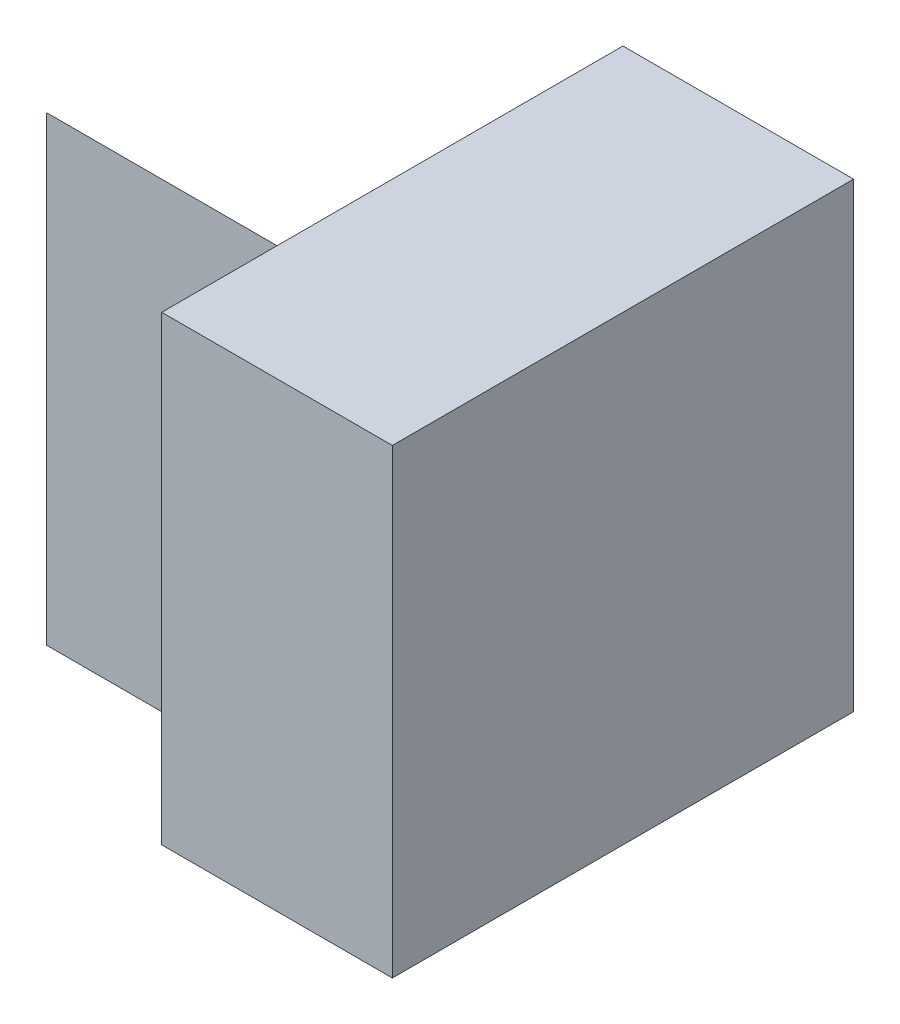
ISO-10303-21;
HEADER;
FILE_DESCRIPTION(('STEP AP214'),'2;1');
FILE_NAME('part.step','',(''),(''),'','','');
FILE_SCHEMA(('AUTOMOTIVE_DESIGN { 1 0 10303 214 1 1 1 1 }'));
ENDSEC;
DATA;
#1=APPLICATION_CONTEXT('core data for automotive mechanical design processes');
#2=APPLICATION_PROTOCOL_DEFINITION('international standard','automotive_design',2000,#1);
#3=PRODUCT_CONTEXT('',#1,'mechanical');
#4=PRODUCT('Part','Part','',(#3));
#5=PRODUCT_RELATED_PRODUCT_CATEGORY('part','',(#4));
#6=PRODUCT_DEFINITION_FORMATION('','',#4);
#7=PRODUCT_DEFINITION_CONTEXT('part definition',#1,'design');
#8=PRODUCT_DEFINITION('design','',#6,#7);
#9=PRODUCT_DEFINITION_SHAPE('','',#8);
#10=(LENGTH_UNIT() NAMED_UNIT(*) SI_UNIT(.MILLI.,.METRE.));
#11=(NAMED_UNIT(*) PLANE_ANGLE_UNIT() SI_UNIT($,.RADIAN.));
#12=(NAMED_UNIT(*) SI_UNIT($,.STERADIAN.) SOLID_ANGLE_UNIT());
#13=UNCERTAINTY_MEASURE_WITH_UNIT(LENGTH_MEASURE(1.E-05),#10,'distance_accuracy_value','');
#14=(GEOMETRIC_REPRESENTATION_CONTEXT(3) GLOBAL_UNCERTAINTY_ASSIGNED_CONTEXT((#13)) GLOBAL_UNIT_ASSIGNED_CONTEXT((#10,
#11,#12)) REPRESENTATION_CONTEXT('',''));
#15=CARTESIAN_POINT('',(0.,0.,0.));
#16=DIRECTION('',(0.,0.,1.));
#17=DIRECTION('',(1.,0.,0.));
#18=AXIS2_PLACEMENT_3D('',#15,#16,#17);
#19=CARTESIAN_POINT('',(2.,0.,-4.));
#20=DIRECTION('',(0.,0.,1.));
#21=DIRECTION('',(1.,0.,0.));
#22=AXIS2_PLACEMENT_3D('',#19,#20,#21);
#23=PLANE('',#22);
#24=DIRECTION('',(0.,-1.,0.));
#25=VECTOR('',#24,1.);
#26=CARTESIAN_POINT('',(0.,0.,-4.));
#27=LINE('',#26,#25);
#28=CARTESIAN_POINT('',(0.,4.,-4.));
#29=VERTEX_POINT('',#28);
#30=CARTESIAN_POINT('',(0.,0.,-4.));
#31=VERTEX_POINT('',#30);
#32=EDGE_CURVE('E102',#29,#31,#27,.T.);
#33=ORIENTED_EDGE('',*,*,#32,.F.);
#34=DIRECTION('',(-1.,0.,0.));
#35=VECTOR('',#34,1.);
#36=CARTESIAN_POINT('',(2.,4.,-4.));
#37=LINE('',#36,#35);
#38=CARTESIAN_POINT('',(2.,4.,-4.));
#39=VERTEX_POINT('',#38);
#40=EDGE_CURVE('E112',#39,#29,#37,.T.);
#41=ORIENTED_EDGE('',*,*,#40,.F.);
#42=DIRECTION('',(0.,1.,0.));
#43=VECTOR('',#42,1.);
#44=CARTESIAN_POINT('',(2.,0.,-4.));
#45=LINE('',#44,#43);
#46=CARTESIAN_POINT('',(2.,0.,-4.));
#47=VERTEX_POINT('',#46);
#48=EDGE_CURVE('E134',#47,#39,#45,.T.);
#49=ORIENTED_EDGE('',*,*,#48,.F.);
#50=DIRECTION('',(-1.,0.,0.));
#51=VECTOR('',#50,1.);
#52=CARTESIAN_POINT('',(2.,0.,-4.));
#53=LINE('',#52,#51);
#54=EDGE_CURVE('E42',#47,#31,#53,.T.);
#55=ORIENTED_EDGE('',*,*,#54,.T.);
#56=EDGE_LOOP('',(#33,#41,#49,#55));
#57=FACE_BOUND('',#56,.T.);
#58=ADVANCED_FACE('F33',(#57),#23,.F.);
#59=CARTESIAN_POINT('',(2.,4.,0.));
#60=DIRECTION('',(0.,-1.,0.));
#61=DIRECTION('',(0.,0.,-1.));
#62=AXIS2_PLACEMENT_3D('',#59,#60,#61);
#63=PLANE('',#62);
#64=DIRECTION('',(0.,0.,-1.));
#65=VECTOR('',#64,1.);
#66=CARTESIAN_POINT('',(0.,4.,-4.));
#67=LINE('',#66,#65);
#68=CARTESIAN_POINT('',(0.,4.,-1.));
#69=VERTEX_POINT('',#68);
#70=EDGE_CURVE('E99',#69,#29,#67,.T.);
#71=ORIENTED_EDGE('',*,*,#70,.F.);
#72=DIRECTION('',(0.,0.,1.));
#73=VECTOR('',#72,1.);
#74=CARTESIAN_POINT('',(0.,4.,0.));
#75=LINE('',#74,#73);
#76=CARTESIAN_POINT('',(0.,4.,0.));
#77=VERTEX_POINT('',#76);
#78=EDGE_CURVE('E72',#69,#77,#75,.T.);
#79=ORIENTED_EDGE('',*,*,#78,.T.);
#80=DIRECTION('',(-1.,0.,0.));
#81=VECTOR('',#80,1.);
#82=CARTESIAN_POINT('',(2.,4.,0.));
#83=LINE('',#82,#81);
#84=CARTESIAN_POINT('',(2.,4.,0.));
#85=VERTEX_POINT('',#84);
#86=EDGE_CURVE('E115',#85,#77,#83,.T.);
#87=ORIENTED_EDGE('',*,*,#86,.F.);
#88=DIRECTION('',(0.,0.,1.));
#89=VECTOR('',#88,1.);
#90=CARTESIAN_POINT('',(2.,4.,0.));
#91=LINE('',#90,#89);
#92=EDGE_CURVE('E59',#39,#85,#91,.T.);
#93=ORIENTED_EDGE('',*,*,#92,.F.);
#94=ORIENTED_EDGE('',*,*,#40,.T.);
#95=EDGE_LOOP('',(#71,#79,#87,#93,#94));
#96=FACE_BOUND('',#95,.T.);
#97=ADVANCED_FACE('F114',(#96),#63,.F.);
#98=CARTESIAN_POINT('',(2.,0.,0.));
#99=DIRECTION('',(0.,0.,-1.));
#100=DIRECTION('',(-1.,0.,0.));
#101=AXIS2_PLACEMENT_3D('',#98,#99,#100);
#102=PLANE('',#101);
#103=DIRECTION('',(0.,-1.,0.));
#104=VECTOR('',#103,1.);
#105=CARTESIAN_POINT('',(0.,0.,0.));
#106=LINE('',#105,#104);
#107=CARTESIAN_POINT('',(0.,0.,0.));
#108=VERTEX_POINT('',#107);
#109=EDGE_CURVE('E129',#77,#108,#106,.T.);
#110=ORIENTED_EDGE('',*,*,#109,.T.);
#111=DIRECTION('',(-1.,0.,0.));
#112=VECTOR('',#111,1.);
#113=CARTESIAN_POINT('',(2.,0.,0.));
#114=LINE('',#113,#112);
#115=CARTESIAN_POINT('',(2.,0.,0.));
#116=VERTEX_POINT('',#115);
#117=EDGE_CURVE('E11',#116,#108,#114,.T.);
#118=ORIENTED_EDGE('',*,*,#117,.F.);
#119=DIRECTION('',(0.,-1.,0.));
#120=VECTOR('',#119,1.);
#121=CARTESIAN_POINT('',(2.,0.,0.));
#122=LINE('',#121,#120);
#123=EDGE_CURVE('E122',#85,#116,#122,.T.);
#124=ORIENTED_EDGE('',*,*,#123,.F.);
#125=ORIENTED_EDGE('',*,*,#86,.T.);
#126=EDGE_LOOP('',(#110,#118,#124,#125));
#127=FACE_BOUND('',#126,.T.);
#128=ADVANCED_FACE('F35',(#127),#102,.F.);
#129=CARTESIAN_POINT('',(2.,0.,0.));
#130=DIRECTION('',(0.,1.,0.));
#131=DIRECTION('',(0.,0.,1.));
#132=AXIS2_PLACEMENT_3D('',#129,#130,#131);
#133=PLANE('',#132);
#134=DIRECTION('',(0.,0.,-1.));
#135=VECTOR('',#134,1.);
#136=CARTESIAN_POINT('',(0.,0.,0.));
#137=LINE('',#136,#135);
#138=CARTESIAN_POINT('',(0.,0.,-1.));
#139=VERTEX_POINT('',#138);
#140=EDGE_CURVE('E123',#108,#139,#137,.T.);
#141=ORIENTED_EDGE('',*,*,#140,.T.);
#142=DIRECTION('',(1.,0.,0.));
#143=VECTOR('',#142,1.);
#144=CARTESIAN_POINT('',(-2.,0.,-1.));
#145=LINE('',#144,#143);
#146=CARTESIAN_POINT('',(-2.,0.,-1.));
#147=VERTEX_POINT('',#146);
#148=EDGE_CURVE('E132',#147,#139,#145,.T.);
#149=ORIENTED_EDGE('',*,*,#148,.F.);
#150=DIRECTION('',(0.,0.,1.));
#151=VECTOR('',#150,1.);
#152=CARTESIAN_POINT('',(-2.,0.,-4.));
#153=LINE('',#152,#151);
#154=CARTESIAN_POINT('',(-2.,0.,-4.));
#155=VERTEX_POINT('',#154);
#156=EDGE_CURVE('E143',#155,#147,#153,.T.);
#157=ORIENTED_EDGE('',*,*,#156,.F.);
#158=DIRECTION('',(-1.,0.,0.));
#159=VECTOR('',#158,1.);
#160=CARTESIAN_POINT('',(0.,0.,-4.));
#161=LINE('',#160,#159);
#162=EDGE_CURVE('E144',#31,#155,#161,.T.);
#163=ORIENTED_EDGE('',*,*,#162,.F.);
#164=ORIENTED_EDGE('',*,*,#54,.F.);
#165=DIRECTION('',(0.,0.,-1.));
#166=VECTOR('',#165,1.);
#167=CARTESIAN_POINT('',(2.,0.,0.));
#168=LINE('',#167,#166);
#169=EDGE_CURVE('E79',#116,#47,#168,.T.);
#170=ORIENTED_EDGE('',*,*,#169,.F.);
#171=ORIENTED_EDGE('',*,*,#117,.T.);
#172=EDGE_LOOP('',(#141,#149,#157,#163,#164,#170,#171));
#173=FACE_BOUND('',#172,.T.);
#174=ADVANCED_FACE('F169',(#173),#133,.F.);
#175=CARTESIAN_POINT('',(2.,0.,0.));
#176=DIRECTION('',(-1.,0.,0.));
#177=DIRECTION('',(0.,0.,1.));
#178=AXIS2_PLACEMENT_3D('',#175,#176,#177);
#179=PLANE('',#178);
#180=ORIENTED_EDGE('',*,*,#123,.T.);
#181=ORIENTED_EDGE('',*,*,#169,.T.);
#182=ORIENTED_EDGE('',*,*,#48,.T.);
#183=ORIENTED_EDGE('',*,*,#92,.T.);
#184=EDGE_LOOP('',(#180,#181,#182,#183));
#185=FACE_BOUND('',#184,.T.);
#186=ADVANCED_FACE('F175',(#185),#179,.F.);
#187=CARTESIAN_POINT('',(0.,0.,0.));
#188=DIRECTION('',(-1.,0.,0.));
#189=DIRECTION('',(0.,0.,1.));
#190=AXIS2_PLACEMENT_3D('',#187,#188,#189);
#191=PLANE('',#190);
#192=DIRECTION('',(0.,1.,0.));
#193=VECTOR('',#192,1.);
#194=CARTESIAN_POINT('',(0.,0.,-1.));
#195=LINE('',#194,#193);
#196=EDGE_CURVE('E50',#139,#69,#195,.T.);
#197=ORIENTED_EDGE('',*,*,#196,.F.);
#198=ORIENTED_EDGE('',*,*,#140,.F.);
#199=ORIENTED_EDGE('',*,*,#109,.F.);
#200=ORIENTED_EDGE('',*,*,#78,.F.);
#201=EDGE_LOOP('',(#197,#198,#199,#200));
#202=FACE_BOUND('',#201,.T.);
#203=ADVANCED_FACE('F172',(#202),#191,.T.);
#204=CARTESIAN_POINT('',(-2.,0.,-1.));
#205=DIRECTION('',(0.,0.,-1.));
#206=DIRECTION('',(-1.,0.,0.));
#207=AXIS2_PLACEMENT_3D('',#204,#205,#206);
#208=PLANE('',#207);
#209=ORIENTED_EDGE('',*,*,#196,.T.);
#210=DIRECTION('',(1.,0.,0.));
#211=VECTOR('',#210,1.);
#212=CARTESIAN_POINT('',(-2.,4.,-1.));
#213=LINE('',#212,#211);
#214=CARTESIAN_POINT('',(-2.,4.,-1.));
#215=VERTEX_POINT('',#214);
#216=EDGE_CURVE('E145',#215,#69,#213,.T.);
#217=ORIENTED_EDGE('',*,*,#216,.F.);
#218=DIRECTION('',(0.,1.,0.));
#219=VECTOR('',#218,1.);
#220=CARTESIAN_POINT('',(-2.,0.,-1.));
#221=LINE('',#220,#219);
#222=EDGE_CURVE('E140',#147,#215,#221,.T.);
#223=ORIENTED_EDGE('',*,*,#222,.F.);
#224=ORIENTED_EDGE('',*,*,#148,.T.);
#225=EDGE_LOOP('',(#209,#217,#223,#224));
#226=FACE_BOUND('',#225,.T.);
#227=ADVANCED_FACE('F167',(#226),#208,.F.);
#228=CARTESIAN_POINT('',(-2.,0.,0.));
#229=DIRECTION('',(-1.,0.,0.));
#230=DIRECTION('',(0.,0.,1.));
#231=AXIS2_PLACEMENT_3D('',#228,#229,#230);
#232=PLANE('',#231);
#233=DIRECTION('',(0.,0.8,0.6));
#234=VECTOR('',#233,1.);
#235=CARTESIAN_POINT('',(-2.,4.,-1.));
#236=LINE('',#235,#234);
#237=EDGE_CURVE('E106',#155,#215,#236,.T.);
#238=ORIENTED_EDGE('',*,*,#237,.F.);
#239=ORIENTED_EDGE('',*,*,#156,.T.);
#240=ORIENTED_EDGE('',*,*,#222,.T.);
#241=EDGE_LOOP('',(#238,#239,#240));
#242=FACE_BOUND('',#241,.T.);
#243=ADVANCED_FACE('F165',(#242),#232,.T.);
#244=CARTESIAN_POINT('',(0.,4.,-1.));
#245=DIRECTION('',(0.,-0.6,0.8));
#246=DIRECTION('',(0.,-0.8,-0.6));
#247=AXIS2_PLACEMENT_3D('',#244,#245,#246);
#248=PLANE('',#247);
#249=ORIENTED_EDGE('',*,*,#237,.T.);
#250=ORIENTED_EDGE('',*,*,#216,.T.);
#251=DIRECTION('',(0.,0.8,0.6));
#252=VECTOR('',#251,1.);
#253=CARTESIAN_POINT('',(0.,4.,-1.));
#254=LINE('',#253,#252);
#255=EDGE_CURVE('E104',#31,#69,#254,.T.);
#256=ORIENTED_EDGE('',*,*,#255,.F.);
#257=ORIENTED_EDGE('',*,*,#162,.T.);
#258=EDGE_LOOP('',(#249,#250,#256,#257));
#259=FACE_BOUND('',#258,.T.);
#260=ADVANCED_FACE('F168',(#259),#248,.F.);
#261=CARTESIAN_POINT('',(0.,0.,0.));
#262=DIRECTION('',(-1.,0.,0.));
#263=DIRECTION('',(0.,0.,1.));
#264=AXIS2_PLACEMENT_3D('',#261,#262,#263);
#265=PLANE('',#264);
#266=ORIENTED_EDGE('',*,*,#70,.T.);
#267=ORIENTED_EDGE('',*,*,#32,.T.);
#268=ORIENTED_EDGE('',*,*,#255,.T.);
#269=EDGE_LOOP('',(#266,#267,#268));
#270=FACE_BOUND('',#269,.T.);
#271=ADVANCED_FACE('F101',(#270),#265,.T.);
#272=CLOSED_SHELL('',(#58,#97,#128,#174,#186,#203,#227,#243,#260,#271));
#273=MANIFOLD_SOLID_BREP('B2',#272);
#274=ADVANCED_BREP_SHAPE_REPRESENTATION('',(#18,#273),#14);
#275=SHAPE_DEFINITION_REPRESENTATION(#9,#274);
ENDSEC;
END-ISO-10303-21;
